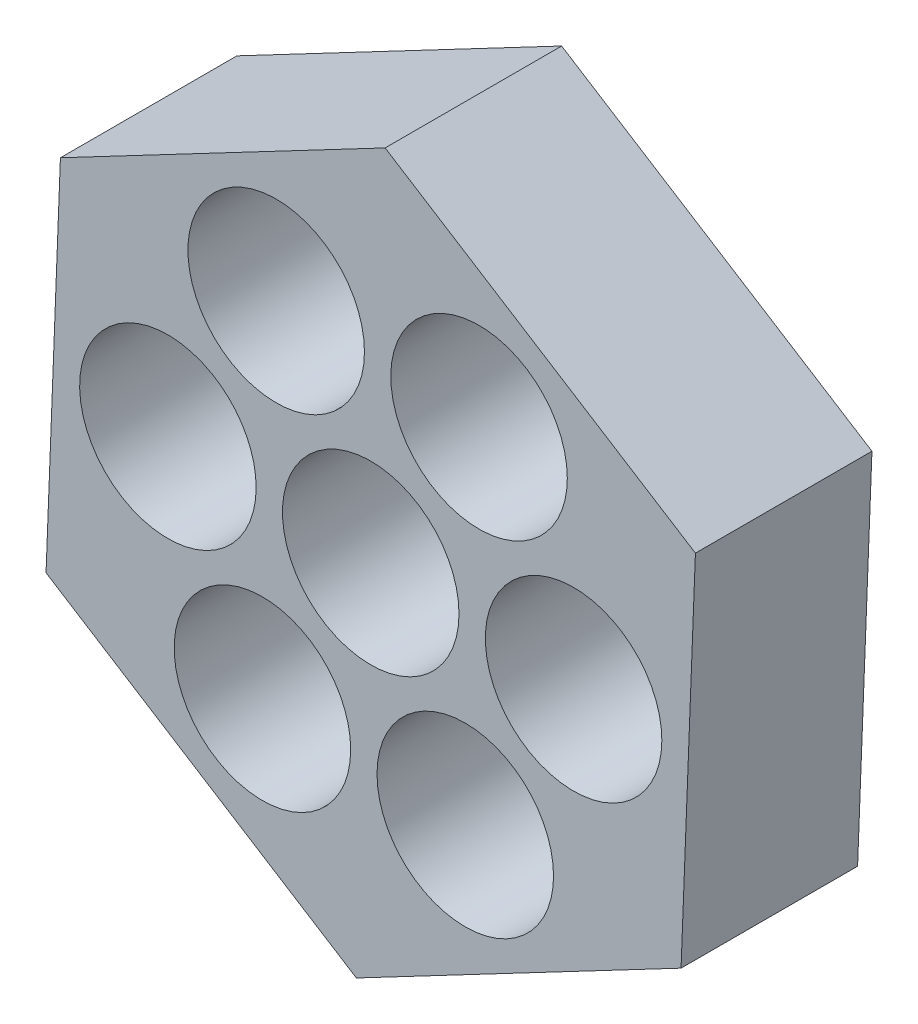
ISO-10303-21;
HEADER;
FILE_DESCRIPTION(('STEP AP214'),'2;1');
FILE_NAME('part.step','',(''),(''),'','','');
FILE_SCHEMA(('AUTOMOTIVE_DESIGN { 1 0 10303 214 1 1 1 1 }'));
ENDSEC;
DATA;
#1=APPLICATION_CONTEXT('core data for automotive mechanical design processes');
#2=APPLICATION_PROTOCOL_DEFINITION('international standard','automotive_design',2000,#1);
#3=PRODUCT_CONTEXT('',#1,'mechanical');
#4=PRODUCT('Part','Part','',(#3));
#5=PRODUCT_RELATED_PRODUCT_CATEGORY('part','',(#4));
#6=PRODUCT_DEFINITION_FORMATION('','',#4);
#7=PRODUCT_DEFINITION_CONTEXT('part definition',#1,'design');
#8=PRODUCT_DEFINITION('design','',#6,#7);
#9=PRODUCT_DEFINITION_SHAPE('','',#8);
#10=(LENGTH_UNIT() NAMED_UNIT(*) SI_UNIT(.MILLI.,.METRE.));
#11=(NAMED_UNIT(*) PLANE_ANGLE_UNIT() SI_UNIT($,.RADIAN.));
#12=(NAMED_UNIT(*) SI_UNIT($,.STERADIAN.) SOLID_ANGLE_UNIT());
#13=UNCERTAINTY_MEASURE_WITH_UNIT(LENGTH_MEASURE(1.E-05),#10,'distance_accuracy_value','');
#14=(GEOMETRIC_REPRESENTATION_CONTEXT(3) GLOBAL_UNCERTAINTY_ASSIGNED_CONTEXT((#13)) GLOBAL_UNIT_ASSIGNED_CONTEXT((#10,
#11,#12)) REPRESENTATION_CONTEXT('',''));
#15=CARTESIAN_POINT('',(0.,0.,0.));
#16=DIRECTION('',(0.,0.,1.));
#17=DIRECTION('',(1.,0.,0.));
#18=AXIS2_PLACEMENT_3D('',#15,#16,#17);
#19=CARTESIAN_POINT('',(0.,0.,5.));
#20=DIRECTION('',(0.,0.,1.));
#21=DIRECTION('',(1.,0.,0.));
#22=AXIS2_PLACEMENT_3D('',#19,#20,#21);
#23=PLANE('',#22);
#24=CARTESIAN_POINT('',(-3.06786128332008,-4.86320132693534,5.));
#25=DIRECTION('',(0.,0.,1.));
#26=DIRECTION('',(-0.500000000000004,0.866025403784436,0.));
#27=AXIS2_PLACEMENT_3D('',#24,#25,#26);
#28=CIRCLE('',#27,2.5);
#29=CARTESIAN_POINT('',(-4.31786128332009,-2.69813781747425,5.));
#30=VERTEX_POINT('',#29);
#31=EDGE_CURVE('E249',#30,#30,#28,.T.);
#32=ORIENTED_EDGE('',*,*,#31,.F.);
#33=EDGE_LOOP('',(#32));
#34=FACE_BOUND('',#33,.T.);
#35=CARTESIAN_POINT('',(2.67772525118413,-5.0884464701096,5.));
#36=DIRECTION('',(0.,0.,1.));
#37=DIRECTION('',(-1.,0.,0.));
#38=AXIS2_PLACEMENT_3D('',#35,#36,#37);
#39=CIRCLE('',#38,2.5);
#40=CARTESIAN_POINT('',(0.17772525118413,-5.0884464701096,5.));
#41=VERTEX_POINT('',#40);
#42=EDGE_CURVE('E245',#41,#41,#39,.T.);
#43=ORIENTED_EDGE('',*,*,#42,.F.);
#44=EDGE_LOOP('',(#43));
#45=FACE_BOUND('',#44,.T.);
#46=CARTESIAN_POINT('',(5.74558653450424,-0.225245143174224,5.));
#47=DIRECTION('',(0.,0.,1.));
#48=DIRECTION('',(-0.499999999999992,-0.866025403784443,0.));
#49=AXIS2_PLACEMENT_3D('',#46,#47,#48);
#50=CIRCLE('',#49,2.5);
#51=CARTESIAN_POINT('',(4.49558653450426,-2.39030865263533,5.));
#52=VERTEX_POINT('',#51);
#53=EDGE_CURVE('E232',#52,#52,#50,.T.);
#54=ORIENTED_EDGE('',*,*,#53,.F.);
#55=EDGE_LOOP('',(#54));
#56=FACE_BOUND('',#55,.T.);
#57=CARTESIAN_POINT('',(3.06786128332005,4.86320132693536,5.));
#58=DIRECTION('',(0.,0.,1.));
#59=DIRECTION('',(0.50000000000001,-0.866025403784433,0.));
#60=AXIS2_PLACEMENT_3D('',#57,#58,#59);
#61=CIRCLE('',#60,2.5);
#62=CARTESIAN_POINT('',(4.31786128332007,2.69813781747428,5.));
#63=VERTEX_POINT('',#62);
#64=EDGE_CURVE('E246',#63,#63,#61,.T.);
#65=ORIENTED_EDGE('',*,*,#64,.F.);
#66=EDGE_LOOP('',(#65));
#67=FACE_BOUND('',#66,.T.);
#68=CARTESIAN_POINT('',(-5.74558653450424,0.225245143174264,5.));
#69=DIRECTION('',(0.,0.,1.));
#70=DIRECTION('',(0.499999999999998,0.86602540378444,0.));
#71=AXIS2_PLACEMENT_3D('',#68,#69,#70);
#72=CIRCLE('',#71,2.5);
#73=CARTESIAN_POINT('',(-4.49558653450424,2.39030865263536,5.));
#74=VERTEX_POINT('',#73);
#75=EDGE_CURVE('E149',#74,#74,#72,.T.);
#76=ORIENTED_EDGE('',*,*,#75,.F.);
#77=EDGE_LOOP('',(#76));
#78=FACE_BOUND('',#77,.T.);
#79=CARTESIAN_POINT('',(-2.67772525118413,5.0884464701096,5.));
#80=DIRECTION('',(0.,0.,1.));
#81=DIRECTION('',(1.,0.,0.));
#82=AXIS2_PLACEMENT_3D('',#79,#80,#81);
#83=CIRCLE('',#82,2.5);
#84=CARTESIAN_POINT('',(-0.17772525118413,5.0884464701096,5.));
#85=VERTEX_POINT('',#84);
#86=EDGE_CURVE('E144',#85,#85,#83,.T.);
#87=ORIENTED_EDGE('',*,*,#86,.F.);
#88=EDGE_LOOP('',(#87));
#89=FACE_BOUND('',#88,.T.);
#90=DIRECTION('',(0.884947212192975,0.465691348032022,0.));
#91=VECTOR('',#90,1.);
#92=CARTESIAN_POINT('',(-0.407098468315802,-10.3843281360469,5.));
#93=LINE('',#92,#91);
#94=CARTESIAN_POINT('',(-0.407098468315802,-10.3843281360469,5.));
#95=VERTEX_POINT('',#94);
#96=CARTESIAN_POINT('',(8.78954273289221,-5.54472168342666,5.));
#97=VERTEX_POINT('',#96);
#98=EDGE_CURVE('E134',#95,#97,#93,.T.);
#99=ORIENTED_EDGE('',*,*,#98,.T.);
#100=DIRECTION('',(0.039173068378135,0.999232440783345,0.));
#101=VECTOR('',#100,1.);
#102=CARTESIAN_POINT('',(8.78954273289221,-5.54472168342666,5.));
#103=LINE('',#102,#101);
#104=CARTESIAN_POINT('',(9.19664120120801,4.83960645262023,5.));
#105=VERTEX_POINT('',#104);
#106=EDGE_CURVE('E92',#97,#105,#103,.T.);
#107=ORIENTED_EDGE('',*,*,#106,.T.);
#108=DIRECTION('',(-0.845774143814839,0.533541092751322,0.));
#109=VECTOR('',#108,1.);
#110=CARTESIAN_POINT('',(9.19664120120801,4.83960645262023,5.));
#111=LINE('',#110,#109);
#112=CARTESIAN_POINT('',(0.407098468315799,10.3843281360469,5.));
#113=VERTEX_POINT('',#112);
#114=EDGE_CURVE('E105',#105,#113,#111,.T.);
#115=ORIENTED_EDGE('',*,*,#114,.T.);
#116=DIRECTION('',(-0.884947212192974,-0.465691348032023,0.));
#117=VECTOR('',#116,1.);
#118=CARTESIAN_POINT('',(0.407098468315799,10.3843281360469,5.));
#119=LINE('',#118,#117);
#120=CARTESIAN_POINT('',(-8.78954273289221,5.54472168342666,5.));
#121=VERTEX_POINT('',#120);
#122=EDGE_CURVE('E99',#113,#121,#119,.T.);
#123=ORIENTED_EDGE('',*,*,#122,.T.);
#124=DIRECTION('',(-0.0391730683781353,-0.999232440783345,0.));
#125=VECTOR('',#124,1.);
#126=CARTESIAN_POINT('',(-8.78954273289221,5.54472168342666,5.));
#127=LINE('',#126,#125);
#128=CARTESIAN_POINT('',(-9.19664120120801,-4.83960645262022,5.));
#129=VERTEX_POINT('',#128);
#130=EDGE_CURVE('E103',#121,#129,#127,.T.);
#131=ORIENTED_EDGE('',*,*,#130,.T.);
#132=DIRECTION('',(0.845774143814839,-0.533541092751323,0.));
#133=VECTOR('',#132,1.);
#134=CARTESIAN_POINT('',(-9.19664120120801,-4.83960645262022,5.));
#135=LINE('',#134,#133);
#136=EDGE_CURVE('E55',#129,#95,#135,.T.);
#137=ORIENTED_EDGE('',*,*,#136,.T.);
#138=EDGE_LOOP('',(#99,#107,#115,#123,#131,#137));
#139=FACE_BOUND('',#138,.T.);
#140=CARTESIAN_POINT('',(0.,0.,5.));
#141=DIRECTION('',(0.,0.,1.));
#142=DIRECTION('',(1.,0.,0.));
#143=AXIS2_PLACEMENT_3D('',#140,#141,#142);
#144=CIRCLE('',#143,2.5);
#145=CARTESIAN_POINT('',(2.5,0.,5.));
#146=VERTEX_POINT('',#145);
#147=EDGE_CURVE('E127',#146,#146,#144,.T.);
#148=ORIENTED_EDGE('',*,*,#147,.F.);
#149=EDGE_LOOP('',(#148));
#150=FACE_BOUND('',#149,.T.);
#151=ADVANCED_FACE('F36',(#34,#45,#56,#67,#78,#89,#139,#150),#23,.T.);
#152=CARTESIAN_POINT('',(0.,0.,0.));
#153=DIRECTION('',(0.,0.,1.));
#154=DIRECTION('',(1.,0.,0.));
#155=AXIS2_PLACEMENT_3D('',#152,#153,#154);
#156=PLANE('',#155);
#157=CARTESIAN_POINT('',(-3.06786128332008,-4.86320132693534,0.));
#158=DIRECTION('',(0.,0.,1.));
#159=DIRECTION('',(1.,0.,0.));
#160=AXIS2_PLACEMENT_3D('',#157,#158,#159);
#161=CIRCLE('',#160,2.5);
#162=CARTESIAN_POINT('',(-0.567861283320082,-4.86320132693534,0.));
#163=VERTEX_POINT('',#162);
#164=EDGE_CURVE('E40',#163,#163,#161,.T.);
#165=ORIENTED_EDGE('',*,*,#164,.T.);
#166=EDGE_LOOP('',(#165));
#167=FACE_BOUND('',#166,.T.);
#168=CARTESIAN_POINT('',(2.67772525118413,-5.0884464701096,0.));
#169=DIRECTION('',(0.,0.,1.));
#170=DIRECTION('',(1.,0.,0.));
#171=AXIS2_PLACEMENT_3D('',#168,#169,#170);
#172=CIRCLE('',#171,2.5);
#173=CARTESIAN_POINT('',(5.17772525118413,-5.0884464701096,0.));
#174=VERTEX_POINT('',#173);
#175=EDGE_CURVE('E154',#174,#174,#172,.T.);
#176=ORIENTED_EDGE('',*,*,#175,.T.);
#177=EDGE_LOOP('',(#176));
#178=FACE_BOUND('',#177,.T.);
#179=CARTESIAN_POINT('',(5.74558653450424,-0.225245143174224,0.));
#180=DIRECTION('',(0.,0.,1.));
#181=DIRECTION('',(1.,0.,0.));
#182=AXIS2_PLACEMENT_3D('',#179,#180,#181);
#183=CIRCLE('',#182,2.5);
#184=CARTESIAN_POINT('',(8.24558653450424,-0.225245143174224,0.));
#185=VERTEX_POINT('',#184);
#186=EDGE_CURVE('E152',#185,#185,#183,.T.);
#187=ORIENTED_EDGE('',*,*,#186,.T.);
#188=EDGE_LOOP('',(#187));
#189=FACE_BOUND('',#188,.T.);
#190=CARTESIAN_POINT('',(3.06786128332005,4.86320132693536,0.));
#191=DIRECTION('',(0.,0.,1.));
#192=DIRECTION('',(1.,0.,0.));
#193=AXIS2_PLACEMENT_3D('',#190,#191,#192);
#194=CIRCLE('',#193,2.5);
#195=CARTESIAN_POINT('',(5.56786128332005,4.86320132693536,0.));
#196=VERTEX_POINT('',#195);
#197=EDGE_CURVE('E148',#196,#196,#194,.T.);
#198=ORIENTED_EDGE('',*,*,#197,.T.);
#199=EDGE_LOOP('',(#198));
#200=FACE_BOUND('',#199,.T.);
#201=CARTESIAN_POINT('',(-5.74558653450424,0.225245143174264,0.));
#202=DIRECTION('',(0.,0.,1.));
#203=DIRECTION('',(1.,0.,0.));
#204=AXIS2_PLACEMENT_3D('',#201,#202,#203);
#205=CIRCLE('',#204,2.5);
#206=CARTESIAN_POINT('',(-3.24558653450423,0.225245143174264,0.));
#207=VERTEX_POINT('',#206);
#208=EDGE_CURVE('E145',#207,#207,#205,.T.);
#209=ORIENTED_EDGE('',*,*,#208,.T.);
#210=EDGE_LOOP('',(#209));
#211=FACE_BOUND('',#210,.T.);
#212=CARTESIAN_POINT('',(-2.67772525118413,5.0884464701096,0.));
#213=DIRECTION('',(0.,0.,1.));
#214=DIRECTION('',(1.,0.,0.));
#215=AXIS2_PLACEMENT_3D('',#212,#213,#214);
#216=CIRCLE('',#215,2.5);
#217=CARTESIAN_POINT('',(-0.17772525118413,5.0884464701096,0.));
#218=VERTEX_POINT('',#217);
#219=EDGE_CURVE('E140',#218,#218,#216,.T.);
#220=ORIENTED_EDGE('',*,*,#219,.T.);
#221=EDGE_LOOP('',(#220));
#222=FACE_BOUND('',#221,.T.);
#223=DIRECTION('',(0.884947212192975,0.465691348032022,0.));
#224=VECTOR('',#223,1.);
#225=CARTESIAN_POINT('',(-0.407098468315802,-10.3843281360469,0.));
#226=LINE('',#225,#224);
#227=CARTESIAN_POINT('',(-0.407098468315802,-10.3843281360469,0.));
#228=VERTEX_POINT('',#227);
#229=CARTESIAN_POINT('',(8.78954273289221,-5.54472168342666,0.));
#230=VERTEX_POINT('',#229);
#231=EDGE_CURVE('E123',#228,#230,#226,.T.);
#232=ORIENTED_EDGE('',*,*,#231,.F.);
#233=DIRECTION('',(0.845774143814839,-0.533541092751323,0.));
#234=VECTOR('',#233,1.);
#235=CARTESIAN_POINT('',(-9.19664120120801,-4.83960645262022,0.));
#236=LINE('',#235,#234);
#237=CARTESIAN_POINT('',(-9.19664120120801,-4.83960645262022,0.));
#238=VERTEX_POINT('',#237);
#239=EDGE_CURVE('E84',#238,#228,#236,.T.);
#240=ORIENTED_EDGE('',*,*,#239,.F.);
#241=DIRECTION('',(-0.0391730683781353,-0.999232440783345,0.));
#242=VECTOR('',#241,1.);
#243=CARTESIAN_POINT('',(-8.78954273289221,5.54472168342666,0.));
#244=LINE('',#243,#242);
#245=CARTESIAN_POINT('',(-8.78954273289221,5.54472168342666,0.));
#246=VERTEX_POINT('',#245);
#247=EDGE_CURVE('E78',#246,#238,#244,.T.);
#248=ORIENTED_EDGE('',*,*,#247,.F.);
#249=DIRECTION('',(-0.884947212192974,-0.465691348032023,0.));
#250=VECTOR('',#249,1.);
#251=CARTESIAN_POINT('',(0.407098468315799,10.3843281360469,0.));
#252=LINE('',#251,#250);
#253=CARTESIAN_POINT('',(0.407098468315799,10.3843281360469,0.));
#254=VERTEX_POINT('',#253);
#255=EDGE_CURVE('E113',#254,#246,#252,.T.);
#256=ORIENTED_EDGE('',*,*,#255,.F.);
#257=DIRECTION('',(-0.845774143814839,0.533541092751322,0.));
#258=VECTOR('',#257,1.);
#259=CARTESIAN_POINT('',(9.19664120120801,4.83960645262023,0.));
#260=LINE('',#259,#258);
#261=CARTESIAN_POINT('',(9.19664120120801,4.83960645262023,0.));
#262=VERTEX_POINT('',#261);
#263=EDGE_CURVE('E129',#262,#254,#260,.T.);
#264=ORIENTED_EDGE('',*,*,#263,.F.);
#265=DIRECTION('',(0.039173068378135,0.999232440783345,0.));
#266=VECTOR('',#265,1.);
#267=CARTESIAN_POINT('',(8.78954273289221,-5.54472168342666,0.));
#268=LINE('',#267,#266);
#269=EDGE_CURVE('E126',#230,#262,#268,.T.);
#270=ORIENTED_EDGE('',*,*,#269,.F.);
#271=EDGE_LOOP('',(#232,#240,#248,#256,#264,#270));
#272=FACE_BOUND('',#271,.T.);
#273=CARTESIAN_POINT('',(0.,0.,0.));
#274=DIRECTION('',(0.,0.,1.));
#275=DIRECTION('',(1.,0.,0.));
#276=AXIS2_PLACEMENT_3D('',#273,#274,#275);
#277=CIRCLE('',#276,2.5);
#278=CARTESIAN_POINT('',(2.5,0.,0.));
#279=VERTEX_POINT('',#278);
#280=EDGE_CURVE('E143',#279,#279,#277,.T.);
#281=ORIENTED_EDGE('',*,*,#280,.T.);
#282=EDGE_LOOP('',(#281));
#283=FACE_BOUND('',#282,.T.);
#284=ADVANCED_FACE('F181',(#167,#178,#189,#200,#211,#222,#272,#283),#156,.F.);
#285=CARTESIAN_POINT('',(-0.407098468315802,-10.3843281360469,5.));
#286=DIRECTION('',(-0.465691348032022,0.884947212192975,0.));
#287=DIRECTION('',(-0.884947212192975,-0.465691348032023,0.));
#288=AXIS2_PLACEMENT_3D('',#285,#286,#287);
#289=PLANE('',#288);
#290=ORIENTED_EDGE('',*,*,#231,.T.);
#291=DIRECTION('',(0.,0.,-1.));
#292=VECTOR('',#291,1.);
#293=CARTESIAN_POINT('',(8.78954273289221,-5.54472168342666,5.));
#294=LINE('',#293,#292);
#295=EDGE_CURVE('E11',#97,#230,#294,.T.);
#296=ORIENTED_EDGE('',*,*,#295,.F.);
#297=ORIENTED_EDGE('',*,*,#98,.F.);
#298=DIRECTION('',(0.,0.,-1.));
#299=VECTOR('',#298,1.);
#300=CARTESIAN_POINT('',(-0.407098468315802,-10.3843281360469,5.));
#301=LINE('',#300,#299);
#302=EDGE_CURVE('E119',#95,#228,#301,.T.);
#303=ORIENTED_EDGE('',*,*,#302,.T.);
#304=EDGE_LOOP('',(#290,#296,#297,#303));
#305=FACE_BOUND('',#304,.T.);
#306=ADVANCED_FACE('F38',(#305),#289,.F.);
#307=CARTESIAN_POINT('',(8.78954273289221,-5.54472168342666,5.));
#308=DIRECTION('',(-0.999232440783345,0.039173068378135,0.));
#309=DIRECTION('',(-0.039173068378135,-0.999232440783345,0.));
#310=AXIS2_PLACEMENT_3D('',#307,#308,#309);
#311=PLANE('',#310);
#312=ORIENTED_EDGE('',*,*,#269,.T.);
#313=DIRECTION('',(0.,0.,-1.));
#314=VECTOR('',#313,1.);
#315=CARTESIAN_POINT('',(9.19664120120801,4.83960645262023,5.));
#316=LINE('',#315,#314);
#317=EDGE_CURVE('E46',#105,#262,#316,.T.);
#318=ORIENTED_EDGE('',*,*,#317,.F.);
#319=ORIENTED_EDGE('',*,*,#106,.F.);
#320=ORIENTED_EDGE('',*,*,#295,.T.);
#321=EDGE_LOOP('',(#312,#318,#319,#320));
#322=FACE_BOUND('',#321,.T.);
#323=ADVANCED_FACE('F175',(#322),#311,.F.);
#324=CARTESIAN_POINT('',(9.19664120120801,4.83960645262023,5.));
#325=DIRECTION('',(-0.533541092751322,-0.845774143814839,0.));
#326=DIRECTION('',(0.84577414381484,-0.533541092751323,0.));
#327=AXIS2_PLACEMENT_3D('',#324,#325,#326);
#328=PLANE('',#327);
#329=ORIENTED_EDGE('',*,*,#263,.T.);
#330=DIRECTION('',(0.,0.,-1.));
#331=VECTOR('',#330,1.);
#332=CARTESIAN_POINT('',(0.407098468315799,10.3843281360469,5.));
#333=LINE('',#332,#331);
#334=EDGE_CURVE('E114',#113,#254,#333,.T.);
#335=ORIENTED_EDGE('',*,*,#334,.F.);
#336=ORIENTED_EDGE('',*,*,#114,.F.);
#337=ORIENTED_EDGE('',*,*,#317,.T.);
#338=EDGE_LOOP('',(#329,#335,#336,#337));
#339=FACE_BOUND('',#338,.T.);
#340=ADVANCED_FACE('F178',(#339),#328,.F.);
#341=CARTESIAN_POINT('',(0.407098468315799,10.3843281360469,5.));
#342=DIRECTION('',(0.465691348032023,-0.884947212192975,0.));
#343=DIRECTION('',(0.884947212192975,0.465691348032023,0.));
#344=AXIS2_PLACEMENT_3D('',#341,#342,#343);
#345=PLANE('',#344);
#346=ORIENTED_EDGE('',*,*,#255,.T.);
#347=DIRECTION('',(0.,0.,-1.));
#348=VECTOR('',#347,1.);
#349=CARTESIAN_POINT('',(-8.78954273289221,5.54472168342666,5.));
#350=LINE('',#349,#348);
#351=EDGE_CURVE('E110',#121,#246,#350,.T.);
#352=ORIENTED_EDGE('',*,*,#351,.F.);
#353=ORIENTED_EDGE('',*,*,#122,.F.);
#354=ORIENTED_EDGE('',*,*,#334,.T.);
#355=EDGE_LOOP('',(#346,#352,#353,#354));
#356=FACE_BOUND('',#355,.T.);
#357=ADVANCED_FACE('F111',(#356),#345,.F.);
#358=CARTESIAN_POINT('',(-8.78954273289221,5.54472168342666,5.));
#359=DIRECTION('',(0.999232440783345,-0.0391730683781353,0.));
#360=DIRECTION('',(0.0391730683781353,0.999232440783345,0.));
#361=AXIS2_PLACEMENT_3D('',#358,#359,#360);
#362=PLANE('',#361);
#363=ORIENTED_EDGE('',*,*,#247,.T.);
#364=DIRECTION('',(0.,0.,-1.));
#365=VECTOR('',#364,1.);
#366=CARTESIAN_POINT('',(-9.19664120120801,-4.83960645262022,5.));
#367=LINE('',#366,#365);
#368=EDGE_CURVE('E115',#129,#238,#367,.T.);
#369=ORIENTED_EDGE('',*,*,#368,.F.);
#370=ORIENTED_EDGE('',*,*,#130,.F.);
#371=ORIENTED_EDGE('',*,*,#351,.T.);
#372=EDGE_LOOP('',(#363,#369,#370,#371));
#373=FACE_BOUND('',#372,.T.);
#374=ADVANCED_FACE('F117',(#373),#362,.F.);
#375=CARTESIAN_POINT('',(-9.19664120120801,-4.83960645262022,5.));
#376=DIRECTION('',(0.533541092751323,0.845774143814839,0.));
#377=DIRECTION('',(-0.845774143814839,0.533541092751323,0.));
#378=AXIS2_PLACEMENT_3D('',#375,#376,#377);
#379=PLANE('',#378);
#380=ORIENTED_EDGE('',*,*,#239,.T.);
#381=ORIENTED_EDGE('',*,*,#302,.F.);
#382=ORIENTED_EDGE('',*,*,#136,.F.);
#383=ORIENTED_EDGE('',*,*,#368,.T.);
#384=EDGE_LOOP('',(#380,#381,#382,#383));
#385=FACE_BOUND('',#384,.T.);
#386=ADVANCED_FACE('F184',(#385),#379,.F.);
#387=CARTESIAN_POINT('',(0.,0.,5.));
#388=DIRECTION('',(0.,0.,-1.));
#389=DIRECTION('',(-1.,0.,0.));
#390=AXIS2_PLACEMENT_3D('',#387,#388,#389);
#391=CYLINDRICAL_SURFACE('',#390,2.5);
#392=ORIENTED_EDGE('',*,*,#147,.T.);
#393=EDGE_LOOP('',(#392));
#394=FACE_BOUND('',#393,.T.);
#395=ORIENTED_EDGE('',*,*,#280,.F.);
#396=EDGE_LOOP('',(#395));
#397=FACE_BOUND('',#396,.T.);
#398=ADVANCED_FACE('F186',(#394,#397),#391,.F.);
#399=CARTESIAN_POINT('',(-2.67772525118413,5.0884464701096,-4.));
#400=DIRECTION('',(0.,0.,1.));
#401=DIRECTION('',(1.,0.,0.));
#402=AXIS2_PLACEMENT_3D('',#399,#400,#401);
#403=CYLINDRICAL_SURFACE('',#402,2.5);
#404=ORIENTED_EDGE('',*,*,#86,.T.);
#405=EDGE_LOOP('',(#404));
#406=FACE_BOUND('',#405,.T.);
#407=ORIENTED_EDGE('',*,*,#219,.F.);
#408=EDGE_LOOP('',(#407));
#409=FACE_BOUND('',#408,.T.);
#410=ADVANCED_FACE('F192',(#406,#409),#403,.F.);
#411=CARTESIAN_POINT('',(-5.74558653450424,0.225245143174264,-4.));
#412=DIRECTION('',(0.,0.,1.));
#413=DIRECTION('',(1.,0.,0.));
#414=AXIS2_PLACEMENT_3D('',#411,#412,#413);
#415=CYLINDRICAL_SURFACE('',#414,2.5);
#416=ORIENTED_EDGE('',*,*,#75,.T.);
#417=EDGE_LOOP('',(#416));
#418=FACE_BOUND('',#417,.T.);
#419=ORIENTED_EDGE('',*,*,#208,.F.);
#420=EDGE_LOOP('',(#419));
#421=FACE_BOUND('',#420,.T.);
#422=ADVANCED_FACE('F208',(#418,#421),#415,.F.);
#423=CARTESIAN_POINT('',(3.06786128332005,4.86320132693536,-4.));
#424=DIRECTION('',(0.,0.,1.));
#425=DIRECTION('',(1.,0.,0.));
#426=AXIS2_PLACEMENT_3D('',#423,#424,#425);
#427=CYLINDRICAL_SURFACE('',#426,2.5);
#428=ORIENTED_EDGE('',*,*,#64,.T.);
#429=EDGE_LOOP('',(#428));
#430=FACE_BOUND('',#429,.T.);
#431=ORIENTED_EDGE('',*,*,#197,.F.);
#432=EDGE_LOOP('',(#431));
#433=FACE_BOUND('',#432,.T.);
#434=ADVANCED_FACE('F211',(#430,#433),#427,.F.);
#435=CARTESIAN_POINT('',(5.74558653450424,-0.225245143174224,-4.));
#436=DIRECTION('',(0.,0.,1.));
#437=DIRECTION('',(1.,0.,0.));
#438=AXIS2_PLACEMENT_3D('',#435,#436,#437);
#439=CYLINDRICAL_SURFACE('',#438,2.5);
#440=ORIENTED_EDGE('',*,*,#53,.T.);
#441=EDGE_LOOP('',(#440));
#442=FACE_BOUND('',#441,.T.);
#443=ORIENTED_EDGE('',*,*,#186,.F.);
#444=EDGE_LOOP('',(#443));
#445=FACE_BOUND('',#444,.T.);
#446=ADVANCED_FACE('F217',(#442,#445),#439,.F.);
#447=CARTESIAN_POINT('',(2.67772525118413,-5.0884464701096,-4.));
#448=DIRECTION('',(0.,0.,1.));
#449=DIRECTION('',(1.,0.,0.));
#450=AXIS2_PLACEMENT_3D('',#447,#448,#449);
#451=CYLINDRICAL_SURFACE('',#450,2.5);
#452=ORIENTED_EDGE('',*,*,#42,.T.);
#453=EDGE_LOOP('',(#452));
#454=FACE_BOUND('',#453,.T.);
#455=ORIENTED_EDGE('',*,*,#175,.F.);
#456=EDGE_LOOP('',(#455));
#457=FACE_BOUND('',#456,.T.);
#458=ADVANCED_FACE('F213',(#454,#457),#451,.F.);
#459=CARTESIAN_POINT('',(-3.06786128332008,-4.86320132693534,-4.));
#460=DIRECTION('',(0.,0.,1.));
#461=DIRECTION('',(1.,0.,0.));
#462=AXIS2_PLACEMENT_3D('',#459,#460,#461);
#463=CYLINDRICAL_SURFACE('',#462,2.5);
#464=ORIENTED_EDGE('',*,*,#31,.T.);
#465=EDGE_LOOP('',(#464));
#466=FACE_BOUND('',#465,.T.);
#467=ORIENTED_EDGE('',*,*,#164,.F.);
#468=EDGE_LOOP('',(#467));
#469=FACE_BOUND('',#468,.T.);
#470=ADVANCED_FACE('F216',(#466,#469),#463,.F.);
#471=CLOSED_SHELL('',(#151,#284,#306,#323,#340,#357,#374,#386,#398,#410,#422,#434,#446,#458,#470));
#472=MANIFOLD_SOLID_BREP('B2',#471);
#473=ADVANCED_BREP_SHAPE_REPRESENTATION('',(#18,#472),#14);
#474=SHAPE_DEFINITION_REPRESENTATION(#9,#473);
ENDSEC;
END-ISO-10303-21;
